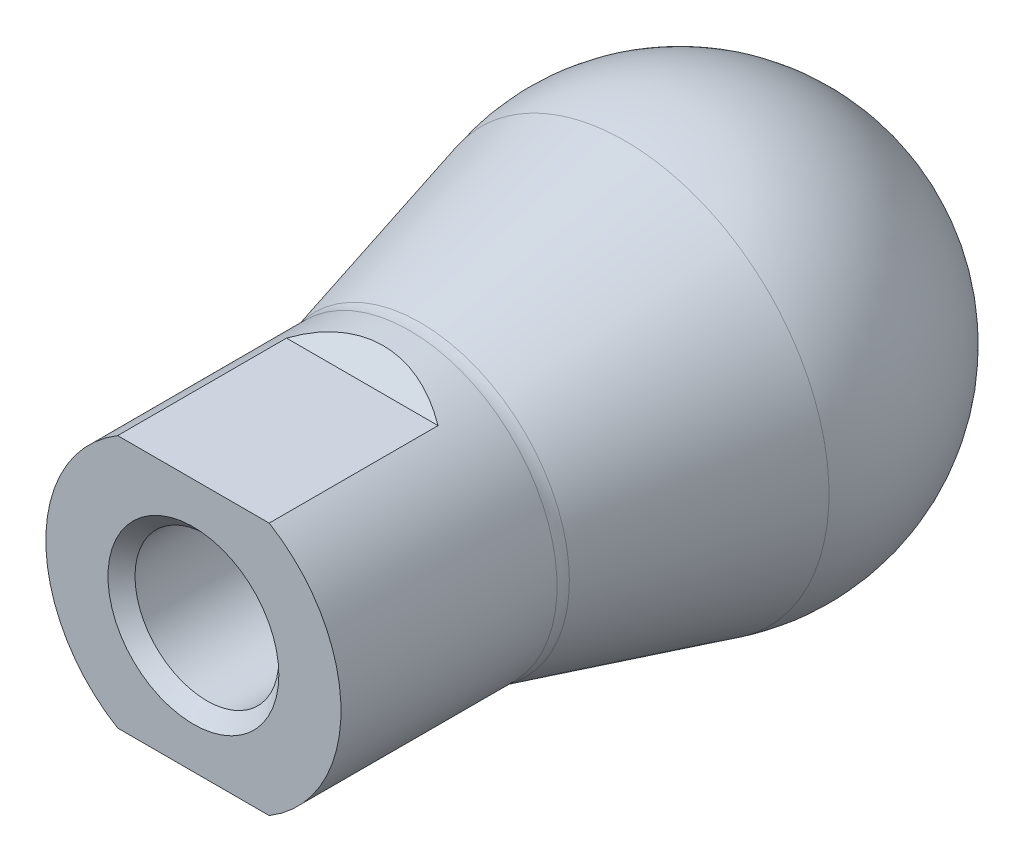
ISO-10303-21;
HEADER;
FILE_DESCRIPTION(('STEP AP214'),'2;1');
FILE_NAME('part.step','',(''),(''),'','','');
FILE_SCHEMA(('AUTOMOTIVE_DESIGN { 1 0 10303 214 1 1 1 1 }'));
ENDSEC;
DATA;
#1=APPLICATION_CONTEXT('core data for automotive mechanical design processes');
#2=APPLICATION_PROTOCOL_DEFINITION('international standard','automotive_design',2000,#1);
#3=PRODUCT_CONTEXT('',#1,'mechanical');
#4=PRODUCT('Part','Part','',(#3));
#5=PRODUCT_RELATED_PRODUCT_CATEGORY('part','',(#4));
#6=PRODUCT_DEFINITION_FORMATION('','',#4);
#7=PRODUCT_DEFINITION_CONTEXT('part definition',#1,'design');
#8=PRODUCT_DEFINITION('design','',#6,#7);
#9=PRODUCT_DEFINITION_SHAPE('','',#8);
#10=(LENGTH_UNIT() NAMED_UNIT(*) SI_UNIT(.MILLI.,.METRE.));
#11=(NAMED_UNIT(*) PLANE_ANGLE_UNIT() SI_UNIT($,.RADIAN.));
#12=(NAMED_UNIT(*) SI_UNIT($,.STERADIAN.) SOLID_ANGLE_UNIT());
#13=UNCERTAINTY_MEASURE_WITH_UNIT(LENGTH_MEASURE(1.E-05),#10,'distance_accuracy_value','');
#14=(GEOMETRIC_REPRESENTATION_CONTEXT(3) GLOBAL_UNCERTAINTY_ASSIGNED_CONTEXT((#13)) GLOBAL_UNIT_ASSIGNED_CONTEXT((#10,
#11,#12)) REPRESENTATION_CONTEXT('',''));
#15=CARTESIAN_POINT('',(0.,0.,0.));
#16=DIRECTION('',(0.,0.,1.));
#17=DIRECTION('',(1.,0.,0.));
#18=AXIS2_PLACEMENT_3D('',#15,#16,#17);
#19=CARTESIAN_POINT('',(0.,0.,-19.05));
#20=DIRECTION('',(0.,0.,1.));
#21=DIRECTION('',(1.,0.,0.));
#22=AXIS2_PLACEMENT_3D('',#19,#20,#21);
#23=PLANE('',#22);
#24=CARTESIAN_POINT('',(0.,0.,-19.0499999999929));
#25=DIRECTION('',(0.,0.,-1.));
#26=DIRECTION('',(-1.,0.,0.));
#27=AXIS2_PLACEMENT_3D('',#24,#25,#26);
#28=CIRCLE('',#27,1.58749999997099);
#29=CARTESIAN_POINT('',(-1.58749999997099,0.,-19.0499999999929));
#30=VERTEX_POINT('',#29);
#31=EDGE_CURVE('E136',#30,#30,#28,.T.);
#32=ORIENTED_EDGE('',*,*,#31,.F.);
#33=EDGE_LOOP('',(#32));
#34=FACE_BOUND('',#33,.T.);
#35=ADVANCED_FACE('F16',(#34),#23,.T.);
#36=CARTESIAN_POINT('',(0.,0.,-20.1675999999793));
#37=DIRECTION('',(0.,0.,-1.));
#38=DIRECTION('',(-1.,0.,0.));
#39=AXIS2_PLACEMENT_3D('',#36,#37,#38);
#40=CONICAL_SURFACE('',#39,2.70509999995738,0.785398163397448);
#41=ORIENTED_EDGE('',*,*,#31,.T.);
#42=EDGE_LOOP('',(#41));
#43=FACE_BOUND('',#42,.T.);
#44=CARTESIAN_POINT('',(0.,3.11060286983338E-13,-20.1676));
#45=DIRECTION('',(0.,0.,-1.));
#46=DIRECTION('',(-1.,0.,0.));
#47=AXIS2_PLACEMENT_3D('',#44,#45,#46);
#48=CIRCLE('',#47,2.7051);
#49=CARTESIAN_POINT('',(-2.7051,3.11060286983338E-13,-20.1676));
#50=VERTEX_POINT('',#49);
#51=EDGE_CURVE('E138',#50,#50,#48,.F.);
#52=ORIENTED_EDGE('',*,*,#51,.T.);
#53=EDGE_LOOP('',(#52));
#54=FACE_BOUND('',#53,.T.);
#55=ADVANCED_FACE('F261',(#43,#54),#40,.T.);
#56=CARTESIAN_POINT('',(0.,0.,-22.225));
#57=DIRECTION('',(0.,0.,-1.));
#58=DIRECTION('',(-1.,0.,0.));
#59=AXIS2_PLACEMENT_3D('',#56,#57,#58);
#60=PLANE('',#59);
#61=DIRECTION('',(0.500000000000017,0.866025403784429,0.));
#62=VECTOR('',#61,1.);
#63=CARTESIAN_POINT('',(1.83308710467698,0.,-22.225));
#64=LINE('',#63,#62);
#65=CARTESIAN_POINT('',(1.83308710467701,0.,-22.225));
#66=VERTEX_POINT('',#65);
#67=CARTESIAN_POINT('',(0.916543552338475,-1.58749999999999,-22.225));
#68=VERTEX_POINT('',#67);
#69=EDGE_CURVE('E462',#66,#68,#64,.F.);
#70=ORIENTED_EDGE('',*,*,#69,.T.);
#71=DIRECTION('',(1.,0.,0.));
#72=VECTOR('',#71,1.);
#73=CARTESIAN_POINT('',(0.91654355233849,-1.5875,-22.225));
#74=LINE('',#73,#72);
#75=CARTESIAN_POINT('',(-0.91654355233849,-1.5875,-22.225));
#76=VERTEX_POINT('',#75);
#77=EDGE_CURVE('E142',#68,#76,#74,.F.);
#78=ORIENTED_EDGE('',*,*,#77,.T.);
#79=DIRECTION('',(0.500000000000017,-0.866025403784429,0.));
#80=VECTOR('',#79,1.);
#81=CARTESIAN_POINT('',(-0.91654355233849,-1.5875,-22.225));
#82=LINE('',#81,#80);
#83=CARTESIAN_POINT('',(-1.83308710467701,0.,-22.225));
#84=VERTEX_POINT('',#83);
#85=EDGE_CURVE('E482',#76,#84,#82,.F.);
#86=ORIENTED_EDGE('',*,*,#85,.T.);
#87=DIRECTION('',(-0.500000000000017,-0.866025403784429,0.));
#88=VECTOR('',#87,1.);
#89=CARTESIAN_POINT('',(-1.83308710467698,0.,-22.225));
#90=LINE('',#89,#88);
#91=CARTESIAN_POINT('',(-0.916543552338459,1.58749999999998,-22.225));
#92=VERTEX_POINT('',#91);
#93=EDGE_CURVE('E477',#84,#92,#90,.F.);
#94=ORIENTED_EDGE('',*,*,#93,.T.);
#95=DIRECTION('',(1.,0.,0.));
#96=VECTOR('',#95,1.);
#97=CARTESIAN_POINT('',(-0.91654355233849,1.5875,-22.225));
#98=LINE('',#97,#96);
#99=CARTESIAN_POINT('',(0.91654355233849,1.5875,-22.225));
#100=VERTEX_POINT('',#99);
#101=EDGE_CURVE('E472',#92,#100,#98,.T.);
#102=ORIENTED_EDGE('',*,*,#101,.T.);
#103=DIRECTION('',(-0.500000000000017,0.866025403784429,0.));
#104=VECTOR('',#103,1.);
#105=CARTESIAN_POINT('',(0.91654355233849,1.5875,-22.225));
#106=LINE('',#105,#104);
#107=EDGE_CURVE('E467',#100,#66,#106,.F.);
#108=ORIENTED_EDGE('',*,*,#107,.T.);
#109=EDGE_LOOP('',(#70,#78,#86,#94,#102,#108));
#110=FACE_BOUND('',#109,.T.);
#111=ADVANCED_FACE('F258',(#110),#60,.T.);
#112=CARTESIAN_POINT('',(0.,3.11060286983338E-13,0.));
#113=DIRECTION('',(0.,0.,-1.));
#114=DIRECTION('',(-1.,0.,0.));
#115=AXIS2_PLACEMENT_3D('',#112,#113,#114);
#116=CYLINDRICAL_SURFACE('',#115,2.7051);
#117=CARTESIAN_POINT('',(0.,3.09431300027363E-13,-0.507975645043696));
#118=DIRECTION('',(0.,0.,1.));
#119=DIRECTION('',(1.,0.,0.));
#120=AXIS2_PLACEMENT_3D('',#117,#118,#119);
#121=CIRCLE('',#120,2.7051);
#122=CARTESIAN_POINT('',(2.7051,3.09431300027363E-13,-0.507975645043696));
#123=VERTEX_POINT('',#122);
#124=EDGE_CURVE('E131',#123,#123,#121,.T.);
#125=ORIENTED_EDGE('',*,*,#124,.T.);
#126=EDGE_LOOP('',(#125));
#127=FACE_BOUND('',#126,.T.);
#128=ORIENTED_EDGE('',*,*,#51,.F.);
#129=EDGE_LOOP('',(#128));
#130=FACE_BOUND('',#129,.T.);
#131=ADVANCED_FACE('F254',(#127,#130),#116,.F.);
#132=CARTESIAN_POINT('',(0.91654355233849,-1.5875,-25.4));
#133=DIRECTION('',(0.,-1.,0.));
#134=DIRECTION('',(0.,0.,-1.));
#135=AXIS2_PLACEMENT_3D('',#132,#133,#134);
#136=PLANE('',#135);
#137=ORIENTED_EDGE('',*,*,#77,.F.);
#138=DIRECTION('',(0.,0.,1.));
#139=VECTOR('',#138,1.);
#140=CARTESIAN_POINT('',(0.916543552338428,-1.58749999999996,-25.4));
#141=LINE('',#140,#139);
#142=CARTESIAN_POINT('',(0.916543552338475,-1.58749999999999,-25.4));
#143=VERTEX_POINT('',#142);
#144=EDGE_CURVE('E135',#68,#143,#141,.F.);
#145=ORIENTED_EDGE('',*,*,#144,.T.);
#146=DIRECTION('',(1.,0.,0.));
#147=VECTOR('',#146,1.);
#148=CARTESIAN_POINT('',(0.,-1.5875,-25.4));
#149=LINE('',#148,#147);
#150=CARTESIAN_POINT('',(-0.91654355233849,-1.5875,-25.4));
#151=VERTEX_POINT('',#150);
#152=EDGE_CURVE('E134',#143,#151,#149,.F.);
#153=ORIENTED_EDGE('',*,*,#152,.T.);
#154=DIRECTION('',(0.,0.,1.));
#155=VECTOR('',#154,1.);
#156=CARTESIAN_POINT('',(-0.91654355233849,-1.5875,-25.4));
#157=LINE('',#156,#155);
#158=EDGE_CURVE('E146',#151,#76,#157,.T.);
#159=ORIENTED_EDGE('',*,*,#158,.T.);
#160=EDGE_LOOP('',(#137,#145,#153,#159));
#161=FACE_BOUND('',#160,.T.);
#162=ADVANCED_FACE('F250',(#161),#136,.F.);
#163=CARTESIAN_POINT('',(-0.91654355233849,-1.5875,-25.4));
#164=DIRECTION('',(-0.866025403784429,-0.500000000000017,0.));
#165=DIRECTION('',(0.500000000000017,-0.866025403784429,0.));
#166=AXIS2_PLACEMENT_3D('',#163,#164,#165);
#167=PLANE('',#166);
#168=ORIENTED_EDGE('',*,*,#85,.F.);
#169=ORIENTED_EDGE('',*,*,#158,.F.);
#170=DIRECTION('',(-0.499999999999983,0.866025403784448,0.));
#171=VECTOR('',#170,1.);
#172=CARTESIAN_POINT('',(-0.91654355233849,-1.5875,-25.4));
#173=LINE('',#172,#171);
#174=CARTESIAN_POINT('',(-1.83308710467701,0.,-25.4));
#175=VERTEX_POINT('',#174);
#176=EDGE_CURVE('E458',#151,#175,#173,.T.);
#177=ORIENTED_EDGE('',*,*,#176,.T.);
#178=DIRECTION('',(0.,0.,1.));
#179=VECTOR('',#178,1.);
#180=CARTESIAN_POINT('',(-1.83308710467698,0.,-25.4));
#181=LINE('',#180,#179);
#182=EDGE_CURVE('E479',#175,#84,#181,.T.);
#183=ORIENTED_EDGE('',*,*,#182,.T.);
#184=EDGE_LOOP('',(#168,#169,#177,#183));
#185=FACE_BOUND('',#184,.T.);
#186=ADVANCED_FACE('F246',(#185),#167,.F.);
#187=CARTESIAN_POINT('',(-1.83308710467698,0.,-25.4));
#188=DIRECTION('',(-0.866025403784429,0.500000000000017,0.));
#189=DIRECTION('',(-0.500000000000017,-0.866025403784429,0.));
#190=AXIS2_PLACEMENT_3D('',#187,#188,#189);
#191=PLANE('',#190);
#192=ORIENTED_EDGE('',*,*,#93,.F.);
#193=ORIENTED_EDGE('',*,*,#182,.F.);
#194=DIRECTION('',(0.499999999999983,0.866025403784448,0.));
#195=VECTOR('',#194,1.);
#196=CARTESIAN_POINT('',(-1.83308710467698,0.,-25.4));
#197=LINE('',#196,#195);
#198=CARTESIAN_POINT('',(-0.916543552338459,1.58749999999998,-25.4));
#199=VERTEX_POINT('',#198);
#200=EDGE_CURVE('E456',#175,#199,#197,.T.);
#201=ORIENTED_EDGE('',*,*,#200,.T.);
#202=DIRECTION('',(0.,0.,1.));
#203=VECTOR('',#202,1.);
#204=CARTESIAN_POINT('',(-0.91654355233849,1.5875,-25.4));
#205=LINE('',#204,#203);
#206=EDGE_CURVE('E474',#199,#92,#205,.T.);
#207=ORIENTED_EDGE('',*,*,#206,.T.);
#208=EDGE_LOOP('',(#192,#193,#201,#207));
#209=FACE_BOUND('',#208,.T.);
#210=ADVANCED_FACE('F242',(#209),#191,.F.);
#211=CARTESIAN_POINT('',(-0.91654355233849,1.5875,-25.4));
#212=DIRECTION('',(0.,1.,0.));
#213=DIRECTION('',(0.,0.,1.));
#214=AXIS2_PLACEMENT_3D('',#211,#212,#213);
#215=PLANE('',#214);
#216=ORIENTED_EDGE('',*,*,#101,.F.);
#217=ORIENTED_EDGE('',*,*,#206,.F.);
#218=DIRECTION('',(1.,0.,0.));
#219=VECTOR('',#218,1.);
#220=CARTESIAN_POINT('',(0.,1.5875,-25.4));
#221=LINE('',#220,#219);
#222=CARTESIAN_POINT('',(0.91654355233849,1.5875,-25.4));
#223=VERTEX_POINT('',#222);
#224=EDGE_CURVE('E454',#199,#223,#221,.T.);
#225=ORIENTED_EDGE('',*,*,#224,.T.);
#226=DIRECTION('',(0.,0.,1.));
#227=VECTOR('',#226,1.);
#228=CARTESIAN_POINT('',(0.91654355233849,1.5875,-25.4));
#229=LINE('',#228,#227);
#230=EDGE_CURVE('E469',#223,#100,#229,.T.);
#231=ORIENTED_EDGE('',*,*,#230,.T.);
#232=EDGE_LOOP('',(#216,#217,#225,#231));
#233=FACE_BOUND('',#232,.T.);
#234=ADVANCED_FACE('F238',(#233),#215,.F.);
#235=CARTESIAN_POINT('',(0.91654355233849,1.5875,-25.4));
#236=DIRECTION('',(0.866025403784429,0.500000000000017,0.));
#237=DIRECTION('',(-0.500000000000017,0.866025403784429,0.));
#238=AXIS2_PLACEMENT_3D('',#235,#236,#237);
#239=PLANE('',#238);
#240=ORIENTED_EDGE('',*,*,#107,.F.);
#241=ORIENTED_EDGE('',*,*,#230,.F.);
#242=DIRECTION('',(0.499999999999983,-0.866025403784448,0.));
#243=VECTOR('',#242,1.);
#244=CARTESIAN_POINT('',(0.91654355233849,1.5875,-25.4));
#245=LINE('',#244,#243);
#246=CARTESIAN_POINT('',(1.83308710467701,0.,-25.4));
#247=VERTEX_POINT('',#246);
#248=EDGE_CURVE('E452',#223,#247,#245,.T.);
#249=ORIENTED_EDGE('',*,*,#248,.T.);
#250=DIRECTION('',(0.,0.,1.));
#251=VECTOR('',#250,1.);
#252=CARTESIAN_POINT('',(1.83308710467698,0.,-25.4));
#253=LINE('',#252,#251);
#254=EDGE_CURVE('E464',#247,#66,#253,.T.);
#255=ORIENTED_EDGE('',*,*,#254,.T.);
#256=EDGE_LOOP('',(#240,#241,#249,#255));
#257=FACE_BOUND('',#256,.T.);
#258=ADVANCED_FACE('F234',(#257),#239,.F.);
#259=CARTESIAN_POINT('',(1.83308710467698,0.,-25.4));
#260=DIRECTION('',(0.866025403784429,-0.500000000000017,0.));
#261=DIRECTION('',(0.500000000000017,0.866025403784429,0.));
#262=AXIS2_PLACEMENT_3D('',#259,#260,#261);
#263=PLANE('',#262);
#264=ORIENTED_EDGE('',*,*,#69,.F.);
#265=ORIENTED_EDGE('',*,*,#254,.F.);
#266=DIRECTION('',(-0.499999999999983,-0.866025403784448,0.));
#267=VECTOR('',#266,1.);
#268=CARTESIAN_POINT('',(1.83308710467698,0.,-25.4));
#269=LINE('',#268,#267);
#270=EDGE_CURVE('E449',#247,#143,#269,.T.);
#271=ORIENTED_EDGE('',*,*,#270,.T.);
#272=ORIENTED_EDGE('',*,*,#144,.F.);
#273=EDGE_LOOP('',(#264,#265,#271,#272));
#274=FACE_BOUND('',#273,.T.);
#275=ADVANCED_FACE('F230',(#274),#263,.F.);
#276=CARTESIAN_POINT('',(0.,3.09431300027363E-13,1.21423227028572E-05));
#277=DIRECTION('',(0.,0.,1.));
#278=DIRECTION('',(1.,0.,0.));
#279=AXIS2_PLACEMENT_3D('',#276,#277,#278);
#280=CONICAL_SURFACE('',#279,3.21308321389355,0.785393661819312);
#281=ORIENTED_EDGE('',*,*,#124,.F.);
#282=EDGE_LOOP('',(#281));
#283=FACE_BOUND('',#282,.T.);
#284=CARTESIAN_POINT('',(0.,3.09431300027363E-13,0.));
#285=DIRECTION('',(0.,0.,1.));
#286=DIRECTION('',(1.,0.,0.));
#287=AXIS2_PLACEMENT_3D('',#284,#285,#286);
#288=CIRCLE('',#287,3.21307107168017);
#289=CARTESIAN_POINT('',(3.21307107168017,3.09431300027363E-13,0.));
#290=VERTEX_POINT('',#289);
#291=EDGE_CURVE('E107',#290,#290,#288,.F.);
#292=ORIENTED_EDGE('',*,*,#291,.F.);
#293=EDGE_LOOP('',(#292));
#294=FACE_BOUND('',#293,.T.);
#295=ADVANCED_FACE('F226',(#283,#294),#280,.F.);
#296=CARTESIAN_POINT('',(0.,0.,-25.4));
#297=DIRECTION('',(0.,0.,1.));
#298=DIRECTION('',(1.,0.,0.));
#299=AXIS2_PLACEMENT_3D('',#296,#297,#298);
#300=PLANE('',#299);
#301=ORIENTED_EDGE('',*,*,#248,.F.);
#302=ORIENTED_EDGE('',*,*,#224,.F.);
#303=ORIENTED_EDGE('',*,*,#200,.F.);
#304=ORIENTED_EDGE('',*,*,#176,.F.);
#305=ORIENTED_EDGE('',*,*,#152,.F.);
#306=ORIENTED_EDGE('',*,*,#270,.F.);
#307=EDGE_LOOP('',(#301,#302,#303,#304,#305,#306));
#308=FACE_BOUND('',#307,.T.);
#309=CARTESIAN_POINT('',(0.,0.,-25.3999999999905));
#310=DIRECTION('',(0.,0.,1.));
#311=DIRECTION('',(1.,0.,0.));
#312=AXIS2_PLACEMENT_3D('',#309,#310,#311);
#313=CIRCLE('',#312,2.66700000003084);
#314=CARTESIAN_POINT('',(2.66700000003084,0.,-25.3999999999905));
#315=VERTEX_POINT('',#314);
#316=EDGE_CURVE('E127',#315,#315,#313,.T.);
#317=ORIENTED_EDGE('',*,*,#316,.F.);
#318=EDGE_LOOP('',(#317));
#319=FACE_BOUND('',#318,.T.);
#320=ADVANCED_FACE('F222',(#308,#319),#300,.F.);
#321=CARTESIAN_POINT('',(-9.525,4.7625,-6.35));
#322=DIRECTION('',(0.,-0.707106781186548,-0.707106781186548));
#323=DIRECTION('',(0.,0.707106781186548,-0.707106781186548));
#324=AXIS2_PLACEMENT_3D('',#321,#322,#323);
#325=PLANE('',#324);
#326=DIRECTION('',(1.,0.,0.));
#327=VECTOR('',#326,1.);
#328=CARTESIAN_POINT('',(-9.525,4.7625,-6.35));
#329=LINE('',#328,#327);
#330=CARTESIAN_POINT('',(-2.84955852019297,4.76249999999985,-6.34999999999986));
#331=VERTEX_POINT('',#330);
#332=CARTESIAN_POINT('',(2.84955852019296,4.76249999999985,-6.34999999999986));
#333=VERTEX_POINT('',#332);
#334=EDGE_CURVE('E123',#331,#333,#329,.T.);
#335=ORIENTED_EDGE('',*,*,#334,.T.);
#336=CARTESIAN_POINT('',(0.,3.07794153970024E-13,-1.58750000000031));
#337=DIRECTION('',(0.,-0.707106781186548,-0.707106781186548));
#338=DIRECTION('',(0.,-0.707106781186548,0.707106781186548));
#339=AXIS2_PLACEMENT_3D('',#336,#337,#338);
#340=ELLIPSE('',#339,7.84874384981444,5.5499);
#341=EDGE_CURVE('E505',#331,#333,#340,.T.);
#342=ORIENTED_EDGE('',*,*,#341,.F.);
#343=EDGE_LOOP('',(#335,#342));
#344=FACE_BOUND('',#343,.T.);
#345=ADVANCED_FACE('F218',(#344),#325,.F.);
#346=CARTESIAN_POINT('',(-9.525,-5.5499,-7.1374));
#347=DIRECTION('',(0.,0.707106781186798,-0.707106781186298));
#348=DIRECTION('',(0.,0.707106781186298,0.707106781186798));
#349=AXIS2_PLACEMENT_3D('',#346,#347,#348);
#350=PLANE('',#349);
#351=DIRECTION('',(1.,0.,0.));
#352=VECTOR('',#351,1.);
#353=CARTESIAN_POINT('',(-9.525,-4.7625,-6.35));
#354=LINE('',#353,#352);
#355=CARTESIAN_POINT('',(2.84955852019115,-4.76250000000019,-6.34999999999991));
#356=VERTEX_POINT('',#355);
#357=CARTESIAN_POINT('',(-2.84955852019115,-4.76250000000019,-6.34999999999991));
#358=VERTEX_POINT('',#357);
#359=EDGE_CURVE('E108',#356,#358,#354,.F.);
#360=ORIENTED_EDGE('',*,*,#359,.T.);
#361=CARTESIAN_POINT('',(0.,3.07794153970024E-13,-1.58749999999577));
#362=DIRECTION('',(0.,0.707106781186798,-0.707106781186298));
#363=DIRECTION('',(0.,0.707106781186298,0.707106781186798));
#364=AXIS2_PLACEMENT_3D('',#361,#362,#363);
#365=ELLIPSE('',#364,7.84874384981721,5.5499);
#366=EDGE_CURVE('E506',#356,#358,#365,.T.);
#367=ORIENTED_EDGE('',*,*,#366,.F.);
#368=EDGE_LOOP('',(#360,#367));
#369=FACE_BOUND('',#368,.T.);
#370=ADVANCED_FACE('F215',(#369),#350,.F.);
#371=CARTESIAN_POINT('',(-9.525,-4.7625,-6.35));
#372=DIRECTION('',(0.,1.,0.));
#373=DIRECTION('',(0.,0.,1.));
#374=AXIS2_PLACEMENT_3D('',#371,#372,#373);
#375=PLANE('',#374);
#376=DIRECTION('',(0.,0.,1.));
#377=VECTOR('',#376,1.);
#378=CARTESIAN_POINT('',(2.84955852019106,-4.76250000000038,-26.67));
#379=LINE('',#378,#377);
#380=CARTESIAN_POINT('',(2.84955852019138,-4.76250000000019,0.));
#381=VERTEX_POINT('',#380);
#382=EDGE_CURVE('E112',#381,#356,#379,.F.);
#383=ORIENTED_EDGE('',*,*,#382,.F.);
#384=DIRECTION('',(1.,0.,0.));
#385=VECTOR('',#384,1.);
#386=CARTESIAN_POINT('',(0.,-4.7625,0.));
#387=LINE('',#386,#385);
#388=CARTESIAN_POINT('',(-2.84955852019138,-4.76250000000019,0.));
#389=VERTEX_POINT('',#388);
#390=EDGE_CURVE('E99',#389,#381,#387,.T.);
#391=ORIENTED_EDGE('',*,*,#390,.F.);
#392=DIRECTION('',(0.,0.,1.));
#393=VECTOR('',#392,1.);
#394=CARTESIAN_POINT('',(-2.84955852019107,-4.76250000000037,-26.67));
#395=LINE('',#394,#393);
#396=EDGE_CURVE('E444',#358,#389,#395,.T.);
#397=ORIENTED_EDGE('',*,*,#396,.F.);
#398=ORIENTED_EDGE('',*,*,#359,.F.);
#399=EDGE_LOOP('',(#383,#391,#397,#398));
#400=FACE_BOUND('',#399,.T.);
#401=ADVANCED_FACE('F113',(#400),#375,.F.);
#402=CARTESIAN_POINT('',(0.,3.11060286983338E-13,0.));
#403=DIRECTION('',(0.,0.,1.));
#404=DIRECTION('',(1.,0.,0.));
#405=AXIS2_PLACEMENT_3D('',#402,#403,#404);
#406=PLANE('',#405);
#407=ORIENTED_EDGE('',*,*,#291,.T.);
#408=EDGE_LOOP('',(#407));
#409=FACE_BOUND('',#408,.T.);
#410=CARTESIAN_POINT('',(0.,3.07794153970024E-13,0.));
#411=DIRECTION('',(0.,0.,1.));
#412=DIRECTION('',(1.,0.,0.));
#413=AXIS2_PLACEMENT_3D('',#410,#411,#412);
#414=CIRCLE('',#413,5.5499);
#415=CARTESIAN_POINT('',(2.84955852019296,4.76249999999985,0.));
#416=VERTEX_POINT('',#415);
#417=EDGE_CURVE('E96',#416,#381,#414,.F.);
#418=ORIENTED_EDGE('',*,*,#417,.F.);
#419=DIRECTION('',(1.,0.,0.));
#420=VECTOR('',#419,1.);
#421=CARTESIAN_POINT('',(-9.525,4.7625,0.));
#422=LINE('',#421,#420);
#423=CARTESIAN_POINT('',(-2.84955852019296,4.76249999999985,0.));
#424=VERTEX_POINT('',#423);
#425=EDGE_CURVE('E121',#416,#424,#422,.F.);
#426=ORIENTED_EDGE('',*,*,#425,.T.);
#427=CARTESIAN_POINT('',(0.,3.07794153970024E-13,0.));
#428=DIRECTION('',(0.,0.,1.));
#429=DIRECTION('',(1.,0.,0.));
#430=AXIS2_PLACEMENT_3D('',#427,#428,#429);
#431=CIRCLE('',#430,5.5499);
#432=EDGE_CURVE('E103',#389,#424,#431,.F.);
#433=ORIENTED_EDGE('',*,*,#432,.F.);
#434=ORIENTED_EDGE('',*,*,#390,.T.);
#435=EDGE_LOOP('',(#418,#426,#433,#434));
#436=FACE_BOUND('',#435,.T.);
#437=ADVANCED_FACE('F101',(#409,#436),#406,.T.);
#438=CARTESIAN_POINT('',(-9.525,4.7625,0.));
#439=DIRECTION('',(0.,-1.,0.));
#440=DIRECTION('',(0.,0.,-1.));
#441=AXIS2_PLACEMENT_3D('',#438,#439,#440);
#442=PLANE('',#441);
#443=DIRECTION('',(0.,0.,1.));
#444=VECTOR('',#443,1.);
#445=CARTESIAN_POINT('',(2.84955852019321,4.76249999999971,-26.67));
#446=LINE('',#445,#444);
#447=EDGE_CURVE('E116',#333,#416,#446,.T.);
#448=ORIENTED_EDGE('',*,*,#447,.F.);
#449=ORIENTED_EDGE('',*,*,#334,.F.);
#450=DIRECTION('',(0.,0.,1.));
#451=VECTOR('',#450,1.);
#452=CARTESIAN_POINT('',(-2.84955852019321,4.76249999999971,-26.67));
#453=LINE('',#452,#451);
#454=EDGE_CURVE('E437',#424,#331,#453,.F.);
#455=ORIENTED_EDGE('',*,*,#454,.F.);
#456=ORIENTED_EDGE('',*,*,#425,.F.);
#457=EDGE_LOOP('',(#448,#449,#455,#456));
#458=FACE_BOUND('',#457,.T.);
#459=ADVANCED_FACE('F205',(#458),#442,.F.);
#460=CARTESIAN_POINT('',(0.,0.,-25.1269632350954));
#461=DIRECTION('',(0.,0.,1.));
#462=DIRECTION('',(1.,0.,0.));
#463=AXIS2_PLACEMENT_3D('',#460,#461,#462);
#464=CONICAL_SURFACE('',#463,2.94003676486909,0.785398163293354);
#465=ORIENTED_EDGE('',*,*,#316,.T.);
#466=EDGE_LOOP('',(#465));
#467=FACE_BOUND('',#466,.T.);
#468=CARTESIAN_POINT('',(0.,3.08585804039756E-13,-25.1269632349818));
#469=DIRECTION('',(0.,0.,-1.));
#470=DIRECTION('',(0.,-1.,0.));
#471=AXIS2_PLACEMENT_3D('',#468,#469,#470);
#472=CIRCLE('',#471,2.94003676498309);
#473=CARTESIAN_POINT('',(0.,-2.94003676498278,-25.1269632349818));
#474=VERTEX_POINT('',#473);
#475=EDGE_CURVE('E434',#474,#474,#472,.T.);
#476=ORIENTED_EDGE('',*,*,#475,.T.);
#477=EDGE_LOOP('',(#476));
#478=FACE_BOUND('',#477,.T.);
#479=ADVANCED_FACE('F201',(#467,#478),#464,.T.);
#480=CARTESIAN_POINT('',(0.,3.07794153970024E-13,-26.67));
#481=DIRECTION('',(0.,0.,1.));
#482=DIRECTION('',(1.,0.,0.));
#483=AXIS2_PLACEMENT_3D('',#480,#481,#482);
#484=CYLINDRICAL_SURFACE('',#483,5.5499);
#485=CARTESIAN_POINT('',(0.,3.10065256874088E-13,-8.1250374390468));
#486=DIRECTION('',(0.,0.,1.));
#487=DIRECTION('',(0.,1.,0.));
#488=AXIS2_PLACEMENT_3D('',#485,#486,#487);
#489=CIRCLE('',#488,5.5499);
#490=CARTESIAN_POINT('',(0.,5.54990000000031,-8.1250374390468));
#491=VERTEX_POINT('',#490);
#492=EDGE_CURVE('E189',#491,#491,#489,.T.);
#493=ORIENTED_EDGE('',*,*,#492,.T.);
#494=EDGE_LOOP('',(#493));
#495=FACE_BOUND('',#494,.T.);
#496=ORIENTED_EDGE('',*,*,#432,.T.);
#497=ORIENTED_EDGE('',*,*,#454,.T.);
#498=ORIENTED_EDGE('',*,*,#341,.T.);
#499=ORIENTED_EDGE('',*,*,#447,.T.);
#500=ORIENTED_EDGE('',*,*,#417,.T.);
#501=ORIENTED_EDGE('',*,*,#382,.T.);
#502=ORIENTED_EDGE('',*,*,#366,.T.);
#503=ORIENTED_EDGE('',*,*,#396,.T.);
#504=EDGE_LOOP('',(#496,#497,#498,#499,#500,#501,#502,#503));
#505=FACE_BOUND('',#504,.T.);
#506=ADVANCED_FACE('F119',(#495,#505),#484,.T.);
#507=CARTESIAN_POINT('',(0.,3.08563938289375E-13,-25.4000121423701));
#508=DIRECTION('',(0.,0.,-1.));
#509=DIRECTION('',(-1.,0.,0.));
#510=AXIS2_PLACEMENT_3D('',#507,#508,#509);
#511=CONICAL_SURFACE('',#510,3.21308321400724,0.785393661789248);
#512=CARTESIAN_POINT('',(0.,3.08563938289375E-13,-25.4));
#513=DIRECTION('',(0.,0.,1.));
#514=DIRECTION('',(1.,0.,0.));
#515=AXIS2_PLACEMENT_3D('',#512,#513,#514);
#516=CIRCLE('',#515,3.21307107174647);
#517=CARTESIAN_POINT('',(3.21307107174647,3.08563938289375E-13,-25.4));
#518=VERTEX_POINT('',#517);
#519=EDGE_CURVE('E160',#518,#518,#516,.F.);
#520=ORIENTED_EDGE('',*,*,#519,.T.);
#521=EDGE_LOOP('',(#520));
#522=FACE_BOUND('',#521,.T.);
#523=ORIENTED_EDGE('',*,*,#475,.F.);
#524=EDGE_LOOP('',(#523));
#525=FACE_BOUND('',#524,.T.);
#526=ADVANCED_FACE('F194',(#522,#525),#511,.F.);
#527=CARTESIAN_POINT('',(0.,3.10065256874088E-13,-8.1250374390468));
#528=DIRECTION('',(0.,0.,1.));
#529=DIRECTION('',(0.,1.,0.));
#530=AXIS2_PLACEMENT_3D('',#527,#528,#529);
#531=TOROIDAL_SURFACE('',#530,7.1247,1.5748);
#532=ORIENTED_EDGE('',*,*,#492,.F.);
#533=EDGE_LOOP('',(#532));
#534=FACE_BOUND('',#533,.T.);
#535=CARTESIAN_POINT('',(0.,3.09543791574628E-13,-8.53262567125057));
#536=DIRECTION('',(0.,0.,-1.));
#537=DIRECTION('',(0.,-1.,0.));
#538=AXIS2_PLACEMENT_3D('',#535,#536,#537);
#539=CIRCLE('',#538,5.60356000875148);
#540=CARTESIAN_POINT('',(0.,-5.60356000875117,-8.53262567125057));
#541=VERTEX_POINT('',#540);
#542=EDGE_CURVE('E154',#541,#541,#539,.T.);
#543=ORIENTED_EDGE('',*,*,#542,.F.);
#544=EDGE_LOOP('',(#543));
#545=FACE_BOUND('',#544,.T.);
#546=ADVANCED_FACE('F191',(#534,#545),#531,.F.);
#547=CARTESIAN_POINT('',(0.,3.07949684113624E-13,-25.4));
#548=DIRECTION('',(0.,0.,1.));
#549=DIRECTION('',(1.,0.,0.));
#550=AXIS2_PLACEMENT_3D('',#547,#548,#549);
#551=PLANE('',#550);
#552=ORIENTED_EDGE('',*,*,#519,.F.);
#553=EDGE_LOOP('',(#552));
#554=FACE_BOUND('',#553,.T.);
#555=CARTESIAN_POINT('',(0.,3.5246790279403,-25.4));
#556=CARTESIAN_POINT('',(-0.0989619337055446,3.52467843489377,-25.4));
#557=CARTESIAN_POINT('',(-0.197942054339634,3.52050749055029,-25.4));
#558=CARTESIAN_POINT('',(-0.395218282421434,3.50385083019374,-25.4));
#559=CARTESIAN_POINT('',(-0.493514179267294,3.49136265939959,-25.4));
#560=CARTESIAN_POINT('',(-0.688869989394536,3.45812773086439,-25.4));
#561=CARTESIAN_POINT('',(-0.785927687079094,3.43736786355844,-25.4));
#562=CARTESIAN_POINT('',(-0.978003178737119,3.38773264329801,-25.4));
#563=CARTESIAN_POINT('',(-1.07301924968138,3.35885070457439,-25.4));
#564=CARTESIAN_POINT('',(-1.35358038434372,3.26042108981452,-25.4));
#565=CARTESIAN_POINT('',(-1.535110530582,3.17900876666429,-25.4));
#566=CARTESIAN_POINT('',(-1.88190607877196,2.98682017124078,-25.4));
#567=CARTESIAN_POINT('',(-2.04717086210411,2.87604278271915,-25.4));
#568=CARTESIAN_POINT('',(-2.27927838974833,2.6903748737732,-25.4));
#569=CARTESIAN_POINT('',(-2.35405968127736,2.6251862467043,-25.4));
#570=CARTESIAN_POINT('',(-2.49781328133337,2.48879241819393,-25.4));
#571=CARTESIAN_POINT('',(-2.56679112107922,2.41759307823481,-25.4));
#572=CARTESIAN_POINT('',(-2.69853375206765,2.26960256324416,-25.4));
#573=CARTESIAN_POINT('',(-2.76129571469701,2.19280886976844,-25.4));
#574=CARTESIAN_POINT('',(-2.88013357861765,2.03421425951473,-25.4));
#575=CARTESIAN_POINT('',(-2.93620792797469,1.95241218712669,-25.4));
#576=CARTESIAN_POINT('',(-3.09373629038176,1.70038536578829,-25.4));
#577=CARTESIAN_POINT('',(-3.18463458718103,1.52338361520341,-25.4));
#578=CARTESIAN_POINT('',(-3.33536959856073,1.15672728114003,-25.4));
#579=CARTESIAN_POINT('',(-3.39520664488983,0.967072832822667,-25.4));
#580=CARTESIAN_POINT('',(-3.48220722249205,0.580385566137424,-25.4));
#581=CARTESIAN_POINT('',(-3.50937057927378,0.383352708371499,-25.4));
#582=CARTESIAN_POINT('',(-3.53022456775354,-0.0124764945889209,-25.4));
#583=CARTESIAN_POINT('',(-3.52391519945156,-0.211272839783416,-25.4));
#584=CARTESIAN_POINT('',(-3.47802817328506,-0.604961198195521,-25.4));
#585=CARTESIAN_POINT('',(-3.43845069308576,-0.799853232258047,-25.4));
#586=CARTESIAN_POINT('',(-3.32707727146393,-1.18031856828839,-25.4));
#587=CARTESIAN_POINT('',(-3.25528098592694,-1.36589177070246,-25.4));
#588=CARTESIAN_POINT('',(-3.1251068993709,-1.63307599708173,-25.4));
#589=CARTESIAN_POINT('',(-3.07793848589685,-1.72031734320348,-25.4));
#590=CARTESIAN_POINT('',(-2.97642313765888,-1.8905211104205,-25.4));
#591=CARTESIAN_POINT('',(-2.92207786766581,-1.97348451765595,-25.4));
#592=CARTESIAN_POINT('',(-2.80661494581125,-2.13449888665374,-25.4));
#593=CARTESIAN_POINT('',(-2.74550037153449,-2.21255205569632,-25.4));
#594=CARTESIAN_POINT('',(-2.61687442760824,-2.36329601256975,-25.4));
#595=CARTESIAN_POINT('',(-2.54935694145341,-2.43598155257057,-25.4));
#596=CARTESIAN_POINT('',(-2.33804375991372,-2.6450107756688,-25.4));
#597=CARTESIAN_POINT('',(-2.18533401886796,-2.77254043264016,-25.4));
#598=CARTESIAN_POINT('',(-1.86065289298704,-3.00010531339273,-25.4));
#599=CARTESIAN_POINT('',(-1.68868224063878,-3.10014158224019,-25.4));
#600=CARTESIAN_POINT('',(-1.42001695159857,-3.22750681222756,-25.4));
#601=CARTESIAN_POINT('',(-1.32856170728173,-3.26621286355121,-25.4));
#602=CARTESIAN_POINT('',(-1.14276504604891,-3.33575601749686,-25.4));
#603=CARTESIAN_POINT('',(-1.04842603463622,-3.36659948837911,-25.4));
#604=CARTESIAN_POINT('',(-0.857643921597791,-3.42017782700399,-25.4));
#605=CARTESIAN_POINT('',(-0.761204400816823,-3.44292549892999,-25.4));
#606=CARTESIAN_POINT('',(-0.566770506978605,-3.4802191368234,-25.4));
#607=CARTESIAN_POINT('',(-0.468776601298279,-3.49476752185304,-25.4));
#608=CARTESIAN_POINT('',(-0.308859010999004,-3.51166568720121,-25.4));
#609=CARTESIAN_POINT('',(-0.247191365753857,-3.51654414567306,-25.4));
#610=CARTESIAN_POINT('',(-0.123684848028099,-3.52305100135365,-25.4));
#611=CARTESIAN_POINT('',(-0.0618459755474871,-3.52467939856241,-25.4));
#612=CARTESIAN_POINT('',(0.098961933705548,-3.52467843489315,-25.4));
#613=CARTESIAN_POINT('',(0.197942054339637,-3.52050749054968,-25.4));
#614=CARTESIAN_POINT('',(0.395218282421437,-3.50385083019312,-25.4));
#615=CARTESIAN_POINT('',(0.493514179267296,-3.49136265939897,-25.4));
#616=CARTESIAN_POINT('',(0.688869989394538,-3.45812773086377,-25.4));
#617=CARTESIAN_POINT('',(0.785927687079096,-3.43736786355783,-25.4));
#618=CARTESIAN_POINT('',(0.978003178737122,-3.3877326432974,-25.4));
#619=CARTESIAN_POINT('',(1.07301924968138,-3.35885070457377,-25.4));
#620=CARTESIAN_POINT('',(1.35358038434373,-3.26042108981391,-25.4));
#621=CARTESIAN_POINT('',(1.535110530582,-3.17900876666367,-25.4));
#622=CARTESIAN_POINT('',(1.88190607877196,-2.98682017124016,-25.4));
#623=CARTESIAN_POINT('',(2.04717086210411,-2.87604278271853,-25.4));
#624=CARTESIAN_POINT('',(2.27927838974834,-2.69037487377258,-25.4));
#625=CARTESIAN_POINT('',(2.35405968127736,-2.62518624670368,-25.4));
#626=CARTESIAN_POINT('',(2.49781328133337,-2.48879241819331,-25.4));
#627=CARTESIAN_POINT('',(2.56679112107921,-2.41759307823419,-25.4));
#628=CARTESIAN_POINT('',(2.69853375206765,-2.26960256324354,-25.4));
#629=CARTESIAN_POINT('',(2.76129571469701,-2.19280886976782,-25.4));
#630=CARTESIAN_POINT('',(2.88013357861765,-2.03421425951412,-25.4));
#631=CARTESIAN_POINT('',(2.9362079279747,-1.95241218712608,-25.4));
#632=CARTESIAN_POINT('',(3.09373629038177,-1.70038536578768,-25.4));
#633=CARTESIAN_POINT('',(3.18463458718104,-1.5233836152028,-25.4));
#634=CARTESIAN_POINT('',(3.33536959856073,-1.15672728113941,-25.4));
#635=CARTESIAN_POINT('',(3.39520664488983,-0.967072832822044,-25.4));
#636=CARTESIAN_POINT('',(3.48220722249204,-0.5803855661368,-25.4));
#637=CARTESIAN_POINT('',(3.50937057927379,-0.383352708370876,-25.4));
#638=CARTESIAN_POINT('',(3.53022456775355,0.0124764945895419,-25.4));
#639=CARTESIAN_POINT('',(3.52391519945156,0.211272839784037,-25.4));
#640=CARTESIAN_POINT('',(3.47802817328505,0.604961198196142,-25.4));
#641=CARTESIAN_POINT('',(3.43845069308576,0.799853232258669,-25.4));
#642=CARTESIAN_POINT('',(3.32707727146394,1.18031856828902,-25.4));
#643=CARTESIAN_POINT('',(3.25528098592694,1.36589177070308,-25.4));
#644=CARTESIAN_POINT('',(3.12510689937089,1.63307599708235,-25.4));
#645=CARTESIAN_POINT('',(3.07793848589685,1.7203173432041,-25.4));
#646=CARTESIAN_POINT('',(2.97642313765887,1.89052111042112,-25.4));
#647=CARTESIAN_POINT('',(2.92207786766581,1.97348451765657,-25.4));
#648=CARTESIAN_POINT('',(2.80661494581124,2.13449888665436,-25.4));
#649=CARTESIAN_POINT('',(2.74550037153449,2.21255205569694,-25.4));
#650=CARTESIAN_POINT('',(2.61687442760823,2.36329601257037,-25.4));
#651=CARTESIAN_POINT('',(2.54935694145341,2.43598155257119,-25.4));
#652=CARTESIAN_POINT('',(2.33804375991372,2.64501077566942,-25.4));
#653=CARTESIAN_POINT('',(2.18533401886796,2.77254043264078,-25.4));
#654=CARTESIAN_POINT('',(1.86065289298704,3.00010531339335,-25.4));
#655=CARTESIAN_POINT('',(1.68868224063878,3.10014158224081,-25.4));
#656=CARTESIAN_POINT('',(1.42001695159857,3.22750681222818,-25.4));
#657=CARTESIAN_POINT('',(1.32856170728174,3.26621286355183,-25.4));
#658=CARTESIAN_POINT('',(1.14276504604891,3.33575601749747,-25.4));
#659=CARTESIAN_POINT('',(1.04842603463622,3.36659948837973,-25.4));
#660=CARTESIAN_POINT('',(0.857643921597792,3.42017782700461,-25.4));
#661=CARTESIAN_POINT('',(0.761204400816824,3.4429254989306,-25.4));
#662=CARTESIAN_POINT('',(0.566770506978607,3.48021913682401,-25.4));
#663=CARTESIAN_POINT('',(0.468776601298282,3.49476752185365,-25.4));
#664=CARTESIAN_POINT('',(0.308859010999008,3.51166568720183,-25.4));
#665=CARTESIAN_POINT('',(0.247191365753861,3.51654414567368,-25.4));
#666=CARTESIAN_POINT('',(0.123684848028102,3.52305100135427,-25.4));
#667=CARTESIAN_POINT('',(0.0618459755474905,3.52467939856302,-25.4));
#668=CARTESIAN_POINT('',(0.,3.5246790279403,-25.4));
#669=B_SPLINE_CURVE_WITH_KNOTS('',3,(#555,#556,#557,#558,#559,#560,#561,#562,#563,#564,#565,
#566,#567,#568,#569,#570,#571,#572,#573,#574,#575,#576,#577,#578,#579,#580,#581,#582,#583,#584,
#585,#586,#587,#588,#589,#590,#591,#592,#593,#594,#595,#596,#597,#598,#599,#600,#601,#602,#603,
#604,#605,#606,#607,#608,#609,#610,#611,#612,#613,#614,#615,#616,#617,#618,#619,#620,#621,#622,
#623,#624,#625,#626,#627,#628,#629,#630,#631,#632,#633,#634,#635,#636,#637,#638,#639,#640,#641,
#642,#643,#644,#645,#646,#647,#648,#649,#650,#651,#652,#653,#654,#655,#656,#657,#658,#659,#660,
#661,#662,#663,#664,#665,#666,#667,#668),.UNSPECIFIED.,.T.,.F.,(4,2,2,2,2,2,2,2,2,2,2,2,2,2,2,2,
2,2,2,2,2,2,2,2,2,2,2,2,2,2,2,2,2,2,2,2,2,2,2,2,2,2,2,2,2,2,2,2,2,2,2,2,2,2,2,2,4),(0.,
0.296828866034421,0.593745378230828,0.891134348329719,1.1887651545723,1.78260799616698,
2.37647341462874,2.67379521663715,2.97083035564716,3.26800004908427,3.56523857038435,
4.15909587181531,4.7529468304422,5.34680096047119,5.94065509050017,6.53450604912706,
7.12836335055802,7.4256018718581,7.72277156529521,8.01980670430522,8.31712850631363,
8.91099392477539,9.50483676637008,9.80246757261266,10.0998565427115,10.396773054908,
10.6936019209424,10.8791042661691,11.0646066113959,11.3614354774303,11.6583519896267,
11.9557409597256,12.2533717659682,12.8472146075629,13.4410800260246,13.738401828033,
14.035436967043,14.3326066604802,14.6298451817802,15.2237024832112,15.8175534418381,
16.4114075718671,17.0052617018961,17.5991126605229,18.1929699619539,18.490208483254,
18.7873781766911,19.0844133157011,19.3817351177095,19.9756005361713,20.569443377766,
20.8670741840085,21.1644631541074,21.4613796663038,21.7582085323383,21.943710877565,
22.1292132227918),.UNSPECIFIED.);
#670=CARTESIAN_POINT('',(0.,3.52467902794049,-25.3999999999999));
#671=VERTEX_POINT('',#670);
#672=EDGE_CURVE('E152',#671,#671,#669,.T.);
#673=ORIENTED_EDGE('',*,*,#672,.F.);
#674=EDGE_LOOP('',(#673));
#675=FACE_BOUND('',#674,.T.);
#676=ADVANCED_FACE('F162',(#554,#675),#551,.F.);
#677=CARTESIAN_POINT('',(0.,3.0964814046186E-13,-16.2336238295211));
#678=DIRECTION('',(0.,0.,-1.));
#679=DIRECTION('',(-1.,0.,0.));
#680=AXIS2_PLACEMENT_3D('',#677,#678,#679);
#681=CONICAL_SURFACE('',#680,7.66703624620422,0.261799387802855);
#682=ORIENTED_EDGE('',*,*,#542,.T.);
#683=EDGE_LOOP('',(#682));
#684=FACE_BOUND('',#683,.T.);
#685=CARTESIAN_POINT('',(0.,3.0964814046186E-13,-16.2336238295211));
#686=DIRECTION('',(0.,0.,-1.));
#687=DIRECTION('',(-1.,0.,0.));
#688=AXIS2_PLACEMENT_3D('',#685,#686,#687);
#689=CIRCLE('',#688,7.66703624620422);
#690=CARTESIAN_POINT('',(-7.66703624620422,3.0964814046186E-13,-16.2336238295211));
#691=VERTEX_POINT('',#690);
#692=EDGE_CURVE('E27',#691,#691,#689,.T.);
#693=ORIENTED_EDGE('',*,*,#692,.F.);
#694=EDGE_LOOP('',(#693));
#695=FACE_BOUND('',#694,.T.);
#696=ADVANCED_FACE('F170',(#684,#695),#681,.T.);
#697=CARTESIAN_POINT('',(0.,3.08820652917022E-13,-18.288));
#698=DIRECTION('',(0.,1.,0.));
#699=DIRECTION('',(-1.,0.,0.));
#700=AXIS2_PLACEMENT_3D('',#697,#698,#699);
#701=SPHERICAL_SURFACE('',#700,7.9375);
#702=CARTESIAN_POINT('',(0.,-7.93749999999969,-18.288));
#703=VERTEX_POINT('',#702);
#704=VERTEX_LOOP('',#703);
#705=FACE_BOUND('',#704,.T.);
#706=ORIENTED_EDGE('',*,*,#692,.T.);
#707=EDGE_LOOP('',(#706));
#708=FACE_BOUND('',#707,.T.);
#709=ORIENTED_EDGE('',*,*,#672,.T.);
#710=CARTESIAN_POINT('',(0.,7.93750000000031,-18.288));
#711=CARTESIAN_POINT('',(0.,7.93750068906408,-18.3798334329221));
#712=CARTESIAN_POINT('',(0.,7.9359063159452,-18.471666824403));
#713=CARTESIAN_POINT('',(0.,7.92953239185027,-18.6552230095974));
#714=CARTESIAN_POINT('',(0.,7.92475284087421,-18.7469458033108));
#715=CARTESIAN_POINT('',(0.,7.91201350757302,-18.9301702780852));
#716=CARTESIAN_POINT('',(0.,7.90405372524789,-19.0216719591461));
#717=CARTESIAN_POINT('',(0.,7.88496373463634,-19.2043439957738));
#718=CARTESIAN_POINT('',(0.,7.87383352634992,-19.2955143513404));
#719=CARTESIAN_POINT('',(0.,7.8484160327425,-19.4774139136781));
#720=CARTESIAN_POINT('',(0.,7.83412874742151,-19.5681431204492));
#721=CARTESIAN_POINT('',(0.,7.80241432541052,-19.7490510958529));
#722=CARTESIAN_POINT('',(0.,7.78498718872053,-19.8392298644855));
#723=CARTESIAN_POINT('',(0.,7.74701405203722,-20.0189283366253));
#724=CARTESIAN_POINT('',(0.,7.72646805204389,-20.1084480401325));
#725=CARTESIAN_POINT('',(0.,7.68228193901517,-20.28672054911));
#726=CARTESIAN_POINT('',(0.,7.65864182597978,-20.3754733545803));
#727=CARTESIAN_POINT('',(0.,7.60829596279091,-20.5521051583073));
#728=CARTESIAN_POINT('',(0.,7.58159021263744,-20.639984156564));
#729=CARTESIAN_POINT('',(0.,7.52514524429826,-20.8147624892643));
#730=CARTESIAN_POINT('',(0.,7.49540602611256,-20.9016618237079));
#731=CARTESIAN_POINT('',(0.,7.43292994472424,-21.0743761522547));
#732=CARTESIAN_POINT('',(0.,7.40019308152162,-21.160191146358));
#733=CARTESIAN_POINT('',(0.,7.33176114402209,-21.3306334238641));
#734=CARTESIAN_POINT('',(0.,7.29606606972517,-21.415260707267));
#735=CARTESIAN_POINT('',(0.,7.22176070733133,-21.5832256236954));
#736=CARTESIAN_POINT('',(0.,7.1831504192344,-21.666563256721));
#737=CARTESIAN_POINT('',(0.,7.1030611381224,-21.8318484861951));
#738=CARTESIAN_POINT('',(0.,7.06158214510733,-21.9137960826436));
#739=CARTESIAN_POINT('',(0.,6.97580541860273,-22.0762025271631));
#740=CARTESIAN_POINT('',(0.,6.9315076851132,-22.1566613752342));
#741=CARTESIAN_POINT('',(0.,6.84014683748006,-22.3159934045035));
#742=CARTESIAN_POINT('',(0.,6.79308372333644,-22.3948665857017));
#743=CARTESIAN_POINT('',(0.,6.69624880531622,-22.5509322727804));
#744=CARTESIAN_POINT('',(0.,6.64647700143963,-22.6281247786609));
#745=CARTESIAN_POINT('',(0.,6.54428465768706,-22.7807361311537));
#746=CARTESIAN_POINT('',(0.,6.49186411781109,-22.856154977766));
#747=CARTESIAN_POINT('',(0.,6.38443744638724,-23.0051281642733));
#748=CARTESIAN_POINT('',(0.,6.32943131483935,-23.0786825041681));
#749=CARTESIAN_POINT('',(0.,6.21689971893116,-23.2238380757239));
#750=CARTESIAN_POINT('',(0.,6.15937425457085,-23.2954393073848));
#751=CARTESIAN_POINT('',(0.,6.04187328661544,-23.436602413616));
#752=CARTESIAN_POINT('',(0.,5.98189778302034,-23.5061642881863));
#753=CARTESIAN_POINT('',(0.,5.85956898142316,-23.6431648879339));
#754=CARTESIAN_POINT('',(0.,5.79721568342108,-23.7106036131113));
#755=CARTESIAN_POINT('',(0.,5.67020640205946,-23.8432766792515));
#756=CARTESIAN_POINT('',(0.,5.60555041869991,-23.9085110202142));
#757=CARTESIAN_POINT('',(0.,5.4740136494367,-24.0366967384675));
#758=CARTESIAN_POINT('',(0.,5.40713286353303,-24.099648115758));
#759=CARTESIAN_POINT('',(0.,5.27122705188187,-24.223192077114));
#760=CARTESIAN_POINT('',(0.,5.20220202613438,-24.2837846611795));
#761=CARTESIAN_POINT('',(0.,5.06209088056849,-24.4025380482045));
#762=CARTESIAN_POINT('',(0.,4.99100476075008,-24.4606988511641));
#763=CARTESIAN_POINT('',(0.,4.84685705487726,-24.5745186161022));
#764=CARTESIAN_POINT('',(0.,4.77379546882283,-24.6301775780807));
#765=CARTESIAN_POINT('',(0.,4.62578484042276,-24.738926619496));
#766=CARTESIAN_POINT('',(0.,4.55083579807712,-24.7920166989329));
#767=CARTESIAN_POINT('',(0.,4.39914053121917,-24.8955640106935));
#768=CARTESIAN_POINT('',(0.,4.32239430670688,-24.9460212430171));
#769=CARTESIAN_POINT('',(0.,4.16719714954863,-25.0442421324309));
#770=CARTESIAN_POINT('',(0.,4.08874621690268,-25.092005789521));
#771=CARTESIAN_POINT('',(0.,3.93023404006126,-25.1847818023816));
#772=CARTESIAN_POINT('',(0.,3.85017279586578,-25.229794158152));
#773=CARTESIAN_POINT('',(0.,3.68853682074528,-25.3170140617194));
#774=CARTESIAN_POINT('',(0.,3.60696208982027,-25.3592216095164));
#775=CARTESIAN_POINT('',(0.,3.52467902794048,-25.3999999999999));
#776=B_SPLINE_CURVE_WITH_KNOTS('',3,(#710,#711,#712,#713,#714,#715,#716,#717,#718,#719,#720,
#721,#722,#723,#724,#725,#726,#727,#728,#729,#730,#731,#732,#733,#734,#735,#736,#737,#738,#739,
#740,#741,#742,#743,#744,#745,#746,#747,#748,#749,#750,#751,#752,#753,#754,#755,#756,#757,#758,
#759,#760,#761,#762,#763,#764,#765,#766,#767,#768,#769,#770,#771,#772,#773,#774,#775),
.UNSPECIFIED.,.F.,.F.,(4,2,2,2,2,2,2,2,2,2,2,2,2,2,2,2,2,2,2,2,2,2,2,2,2,2,2,2,2,2,2,2,4),(0.,
0.275486400532589,0.55097280106518,0.826459201597768,1.10194560213036,1.37743200266295,
1.65291840319554,1.92840480372813,2.20389120426072,2.4793776047933,2.75486400532589,
3.03035040585848,3.30583680639107,3.58132320692366,3.85680960745625,4.13229600798884,
4.40778240852143,4.68326880905402,4.95875520958661,5.2342416101192,5.50972801065179,
5.78521441118437,6.06070081171696,6.33618721224955,6.61167361278214,6.88716001331473,
7.16264641384732,7.43813281437991,7.7136192149125,7.98910561544509,8.26459201597767,
8.54007841651027,8.81556481704285),.UNSPECIFIED.);
#777=CARTESIAN_POINT('',(0.,7.93750000000031,-18.288));
#778=VERTEX_POINT('',#777);
#779=EDGE_CURVE('E11',#778,#671,#776,.T.);
#780=ORIENTED_EDGE('',*,*,#779,.F.);
#781=ORIENTED_EDGE('',*,*,#779,.T.);
#782=EDGE_LOOP('',(#709,#780,#781));
#783=FACE_BOUND('',#782,.T.);
#784=ADVANCED_FACE('F166',(#705,#708,#783),#701,.T.);
#785=CLOSED_SHELL('',(#35,#55,#111,#131,#162,#186,#210,#234,#258,#275,#295,#320,#345,#370,#401,
#437,#459,#479,#506,#526,#546,#676,#696,#784));
#786=MANIFOLD_SOLID_BREP('B1',#785);
#787=ADVANCED_BREP_SHAPE_REPRESENTATION('',(#18,#786),#14);
#788=SHAPE_DEFINITION_REPRESENTATION(#9,#787);
ENDSEC;
END-ISO-10303-21;
